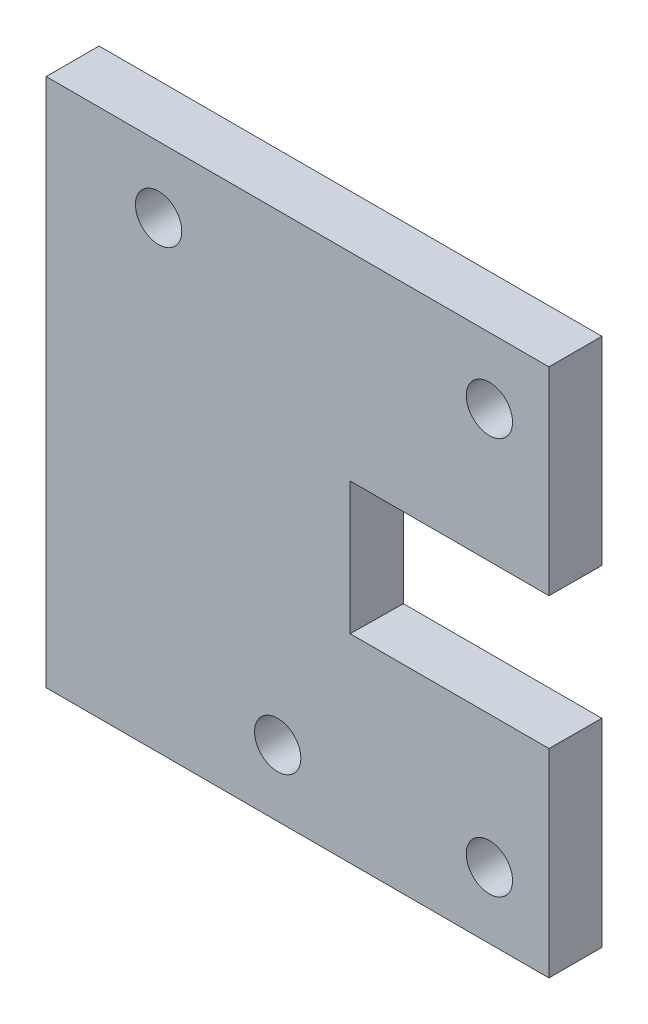
ISO-10303-21;
HEADER;
FILE_DESCRIPTION(('STEP AP214'),'2;1');
FILE_NAME('part.step','',(''),(''),'','','');
FILE_SCHEMA(('AUTOMOTIVE_DESIGN { 1 0 10303 214 1 1 1 1 }'));
ENDSEC;
DATA;
#1=APPLICATION_CONTEXT('core data for automotive mechanical design processes');
#2=APPLICATION_PROTOCOL_DEFINITION('international standard','automotive_design',2000,#1);
#3=PRODUCT_CONTEXT('',#1,'mechanical');
#4=PRODUCT('Part','Part','',(#3));
#5=PRODUCT_RELATED_PRODUCT_CATEGORY('part','',(#4));
#6=PRODUCT_DEFINITION_FORMATION('','',#4);
#7=PRODUCT_DEFINITION_CONTEXT('part definition',#1,'design');
#8=PRODUCT_DEFINITION('design','',#6,#7);
#9=PRODUCT_DEFINITION_SHAPE('','',#8);
#10=(LENGTH_UNIT() NAMED_UNIT(*) SI_UNIT(.MILLI.,.METRE.));
#11=(NAMED_UNIT(*) PLANE_ANGLE_UNIT() SI_UNIT($,.RADIAN.));
#12=(NAMED_UNIT(*) SI_UNIT($,.STERADIAN.) SOLID_ANGLE_UNIT());
#13=UNCERTAINTY_MEASURE_WITH_UNIT(LENGTH_MEASURE(1.E-05),#10,'distance_accuracy_value','');
#14=(GEOMETRIC_REPRESENTATION_CONTEXT(3) GLOBAL_UNCERTAINTY_ASSIGNED_CONTEXT((#13)) GLOBAL_UNIT_ASSIGNED_CONTEXT((#10,
#11,#12)) REPRESENTATION_CONTEXT('',''));
#15=CARTESIAN_POINT('',(0.,0.,0.));
#16=DIRECTION('',(0.,0.,1.));
#17=DIRECTION('',(1.,0.,0.));
#18=AXIS2_PLACEMENT_3D('',#15,#16,#17);
#19=CARTESIAN_POINT('',(0.,0.,4.));
#20=DIRECTION('',(0.,0.,1.));
#21=DIRECTION('',(1.,0.,0.));
#22=AXIS2_PLACEMENT_3D('',#19,#20,#21);
#23=PLANE('',#22);
#24=CARTESIAN_POINT('',(-4.50000000000001,15.,4.));
#25=DIRECTION('',(0.,0.,1.));
#26=DIRECTION('',(1.,0.,0.));
#27=AXIS2_PLACEMENT_3D('',#24,#25,#26);
#28=CIRCLE('',#27,1.75);
#29=CARTESIAN_POINT('',(-2.75000000000001,15.,4.));
#30=VERTEX_POINT('',#29);
#31=EDGE_CURVE('E161',#30,#30,#28,.T.);
#32=ORIENTED_EDGE('',*,*,#31,.F.);
#33=EDGE_LOOP('',(#32));
#34=FACE_BOUND('',#33,.T.);
#35=CARTESIAN_POINT('',(20.5,15.,4.));
#36=DIRECTION('',(0.,0.,1.));
#37=DIRECTION('',(1.,0.,0.));
#38=AXIS2_PLACEMENT_3D('',#35,#36,#37);
#39=CIRCLE('',#38,1.75);
#40=CARTESIAN_POINT('',(22.25,15.,4.));
#41=VERTEX_POINT('',#40);
#42=EDGE_CURVE('E168',#41,#41,#39,.T.);
#43=ORIENTED_EDGE('',*,*,#42,.F.);
#44=EDGE_LOOP('',(#43));
#45=FACE_BOUND('',#44,.T.);
#46=CARTESIAN_POINT('',(20.5,-15.,4.));
#47=DIRECTION('',(0.,0.,1.));
#48=DIRECTION('',(1.,0.,0.));
#49=AXIS2_PLACEMENT_3D('',#46,#47,#48);
#50=CIRCLE('',#49,1.75);
#51=CARTESIAN_POINT('',(22.25,-15.,4.));
#52=VERTEX_POINT('',#51);
#53=EDGE_CURVE('E174',#52,#52,#50,.T.);
#54=ORIENTED_EDGE('',*,*,#53,.F.);
#55=EDGE_LOOP('',(#54));
#56=FACE_BOUND('',#55,.T.);
#57=CARTESIAN_POINT('',(4.5,-15.,4.));
#58=DIRECTION('',(0.,0.,1.));
#59=DIRECTION('',(1.,0.,0.));
#60=AXIS2_PLACEMENT_3D('',#57,#58,#59);
#61=CIRCLE('',#60,1.75);
#62=CARTESIAN_POINT('',(6.25,-15.,4.));
#63=VERTEX_POINT('',#62);
#64=EDGE_CURVE('E180',#63,#63,#61,.T.);
#65=ORIENTED_EDGE('',*,*,#64,.F.);
#66=EDGE_LOOP('',(#65));
#67=FACE_BOUND('',#66,.T.);
#68=DIRECTION('',(0.,-1.,0.));
#69=VECTOR('',#68,1.);
#70=CARTESIAN_POINT('',(9.9725607254456,5.02042421616366,4.));
#71=LINE('',#70,#69);
#72=CARTESIAN_POINT('',(9.9725607254456,5.02042421616366,4.));
#73=VERTEX_POINT('',#72);
#74=CARTESIAN_POINT('',(9.9725607254456,-4.97957578383634,4.));
#75=VERTEX_POINT('',#74);
#76=EDGE_CURVE('E144',#73,#75,#71,.T.);
#77=ORIENTED_EDGE('',*,*,#76,.F.);
#78=DIRECTION('',(-1.,0.,0.));
#79=VECTOR('',#78,1.);
#80=CARTESIAN_POINT('',(9.9725607254456,5.02042421616366,4.));
#81=LINE('',#80,#79);
#82=CARTESIAN_POINT('',(25.,5.02042421616366,4.));
#83=VERTEX_POINT('',#82);
#84=EDGE_CURVE('E119',#83,#73,#81,.T.);
#85=ORIENTED_EDGE('',*,*,#84,.F.);
#86=DIRECTION('',(0.,1.,0.));
#87=VECTOR('',#86,1.);
#88=CARTESIAN_POINT('',(25.,-20.,4.));
#89=LINE('',#88,#87);
#90=CARTESIAN_POINT('',(25.,20.,4.));
#91=VERTEX_POINT('',#90);
#92=EDGE_CURVE('E187',#83,#91,#89,.T.);
#93=ORIENTED_EDGE('',*,*,#92,.T.);
#94=DIRECTION('',(-1.,0.,0.));
#95=VECTOR('',#94,1.);
#96=CARTESIAN_POINT('',(25.,20.,4.));
#97=LINE('',#96,#95);
#98=CARTESIAN_POINT('',(-13.,20.,4.));
#99=VERTEX_POINT('',#98);
#100=EDGE_CURVE('E191',#91,#99,#97,.T.);
#101=ORIENTED_EDGE('',*,*,#100,.T.);
#102=DIRECTION('',(0.,1.,0.));
#103=VECTOR('',#102,1.);
#104=CARTESIAN_POINT('',(-13.,-20.,4.));
#105=LINE('',#104,#103);
#106=CARTESIAN_POINT('',(-13.,-20.,4.));
#107=VERTEX_POINT('',#106);
#108=EDGE_CURVE('E158',#107,#99,#105,.T.);
#109=ORIENTED_EDGE('',*,*,#108,.F.);
#110=DIRECTION('',(1.,0.,0.));
#111=VECTOR('',#110,1.);
#112=CARTESIAN_POINT('',(25.,-20.,4.));
#113=LINE('',#112,#111);
#114=CARTESIAN_POINT('',(25.,-20.,4.));
#115=VERTEX_POINT('',#114);
#116=EDGE_CURVE('E185',#107,#115,#113,.T.);
#117=ORIENTED_EDGE('',*,*,#116,.T.);
#118=CARTESIAN_POINT('',(25.,-4.97957578383634,4.));
#119=VERTEX_POINT('',#118);
#120=EDGE_CURVE('E197',#115,#119,#89,.T.);
#121=ORIENTED_EDGE('',*,*,#120,.T.);
#122=DIRECTION('',(1.,0.,0.));
#123=VECTOR('',#122,1.);
#124=CARTESIAN_POINT('',(9.9725607254456,-4.97957578383634,4.));
#125=LINE('',#124,#123);
#126=EDGE_CURVE('E64',#75,#119,#125,.T.);
#127=ORIENTED_EDGE('',*,*,#126,.F.);
#128=EDGE_LOOP('',(#77,#85,#93,#101,#109,#117,#121,#127));
#129=FACE_BOUND('',#128,.T.);
#130=ADVANCED_FACE('F47',(#34,#45,#56,#67,#129),#23,.T.);
#131=CARTESIAN_POINT('',(0.,0.,0.));
#132=DIRECTION('',(0.,0.,1.));
#133=DIRECTION('',(1.,0.,0.));
#134=AXIS2_PLACEMENT_3D('',#131,#132,#133);
#135=PLANE('',#134);
#136=CARTESIAN_POINT('',(4.5,-15.,0.));
#137=DIRECTION('',(0.,0.,1.));
#138=DIRECTION('',(1.,0.,0.));
#139=AXIS2_PLACEMENT_3D('',#136,#137,#138);
#140=CIRCLE('',#139,1.75);
#141=CARTESIAN_POINT('',(6.25,-15.,0.));
#142=VERTEX_POINT('',#141);
#143=EDGE_CURVE('E160',#142,#142,#140,.T.);
#144=ORIENTED_EDGE('',*,*,#143,.T.);
#145=EDGE_LOOP('',(#144));
#146=FACE_BOUND('',#145,.T.);
#147=CARTESIAN_POINT('',(20.5,-15.,0.));
#148=DIRECTION('',(0.,0.,1.));
#149=DIRECTION('',(1.,0.,0.));
#150=AXIS2_PLACEMENT_3D('',#147,#148,#149);
#151=CIRCLE('',#150,1.75);
#152=CARTESIAN_POINT('',(22.25,-15.,0.));
#153=VERTEX_POINT('',#152);
#154=EDGE_CURVE('E177',#153,#153,#151,.T.);
#155=ORIENTED_EDGE('',*,*,#154,.T.);
#156=EDGE_LOOP('',(#155));
#157=FACE_BOUND('',#156,.T.);
#158=CARTESIAN_POINT('',(20.5,15.,0.));
#159=DIRECTION('',(0.,0.,1.));
#160=DIRECTION('',(1.,0.,0.));
#161=AXIS2_PLACEMENT_3D('',#158,#159,#160);
#162=CIRCLE('',#161,1.75);
#163=CARTESIAN_POINT('',(22.25,15.,0.));
#164=VERTEX_POINT('',#163);
#165=EDGE_CURVE('E171',#164,#164,#162,.T.);
#166=ORIENTED_EDGE('',*,*,#165,.T.);
#167=EDGE_LOOP('',(#166));
#168=FACE_BOUND('',#167,.T.);
#169=CARTESIAN_POINT('',(-4.50000000000001,15.,0.));
#170=DIRECTION('',(0.,0.,1.));
#171=DIRECTION('',(1.,0.,0.));
#172=AXIS2_PLACEMENT_3D('',#169,#170,#171);
#173=CIRCLE('',#172,1.75);
#174=CARTESIAN_POINT('',(-2.75000000000001,15.,0.));
#175=VERTEX_POINT('',#174);
#176=EDGE_CURVE('E165',#175,#175,#173,.T.);
#177=ORIENTED_EDGE('',*,*,#176,.T.);
#178=EDGE_LOOP('',(#177));
#179=FACE_BOUND('',#178,.T.);
#180=DIRECTION('',(-1.,0.,0.));
#181=VECTOR('',#180,1.);
#182=CARTESIAN_POINT('',(26.,5.,0.));
#183=LINE('',#182,#181);
#184=CARTESIAN_POINT('',(25.,5.,0.));
#185=VERTEX_POINT('',#184);
#186=CARTESIAN_POINT('',(9.99999999999999,5.,0.));
#187=VERTEX_POINT('',#186);
#188=EDGE_CURVE('E116',#185,#187,#183,.T.);
#189=ORIENTED_EDGE('',*,*,#188,.T.);
#190=DIRECTION('',(0.,-1.,0.));
#191=VECTOR('',#190,1.);
#192=CARTESIAN_POINT('',(9.99999999999999,5.,0.));
#193=LINE('',#192,#191);
#194=CARTESIAN_POINT('',(9.99999999999999,-5.,0.));
#195=VERTEX_POINT('',#194);
#196=EDGE_CURVE('E126',#187,#195,#193,.T.);
#197=ORIENTED_EDGE('',*,*,#196,.T.);
#198=DIRECTION('',(1.,0.,0.));
#199=VECTOR('',#198,1.);
#200=CARTESIAN_POINT('',(26.,-5.,0.));
#201=LINE('',#200,#199);
#202=CARTESIAN_POINT('',(25.,-5.,0.));
#203=VERTEX_POINT('',#202);
#204=EDGE_CURVE('E131',#195,#203,#201,.T.);
#205=ORIENTED_EDGE('',*,*,#204,.T.);
#206=DIRECTION('',(0.,1.,0.));
#207=VECTOR('',#206,1.);
#208=CARTESIAN_POINT('',(25.,-20.,0.));
#209=LINE('',#208,#207);
#210=CARTESIAN_POINT('',(25.,-20.,0.));
#211=VERTEX_POINT('',#210);
#212=EDGE_CURVE('E202',#211,#203,#209,.T.);
#213=ORIENTED_EDGE('',*,*,#212,.F.);
#214=DIRECTION('',(1.,0.,0.));
#215=VECTOR('',#214,1.);
#216=CARTESIAN_POINT('',(25.,-20.,0.));
#217=LINE('',#216,#215);
#218=CARTESIAN_POINT('',(-13.,-20.,0.));
#219=VERTEX_POINT('',#218);
#220=EDGE_CURVE('E164',#219,#211,#217,.T.);
#221=ORIENTED_EDGE('',*,*,#220,.F.);
#222=DIRECTION('',(0.,-1.,0.));
#223=VECTOR('',#222,1.);
#224=CARTESIAN_POINT('',(-13.,20.,0.));
#225=LINE('',#224,#223);
#226=CARTESIAN_POINT('',(-13.,20.,0.));
#227=VERTEX_POINT('',#226);
#228=EDGE_CURVE('E149',#227,#219,#225,.T.);
#229=ORIENTED_EDGE('',*,*,#228,.F.);
#230=DIRECTION('',(-1.,0.,0.));
#231=VECTOR('',#230,1.);
#232=CARTESIAN_POINT('',(25.,20.,0.));
#233=LINE('',#232,#231);
#234=CARTESIAN_POINT('',(25.,20.,0.));
#235=VERTEX_POINT('',#234);
#236=EDGE_CURVE('E188',#235,#227,#233,.T.);
#237=ORIENTED_EDGE('',*,*,#236,.F.);
#238=EDGE_CURVE('E136',#185,#235,#209,.T.);
#239=ORIENTED_EDGE('',*,*,#238,.F.);
#240=EDGE_LOOP('',(#189,#197,#205,#213,#221,#229,#237,#239));
#241=FACE_BOUND('',#240,.T.);
#242=ADVANCED_FACE('F134',(#146,#157,#168,#179,#241),#135,.F.);
#243=CARTESIAN_POINT('',(25.,-20.,4.));
#244=DIRECTION('',(-1.,0.,0.));
#245=DIRECTION('',(0.,0.,1.));
#246=AXIS2_PLACEMENT_3D('',#243,#244,#245);
#247=PLANE('',#246);
#248=DIRECTION('',(0.,0.0051059874802384,0.999986964360962));
#249=VECTOR('',#248,1.);
#250=CARTESIAN_POINT('',(25.,5.019771905978,3.87224769255669));
#251=LINE('',#250,#249);
#252=EDGE_CURVE('E12',#185,#83,#251,.T.);
#253=ORIENTED_EDGE('',*,*,#252,.F.);
#254=ORIENTED_EDGE('',*,*,#238,.T.);
#255=DIRECTION('',(0.,0.,-1.));
#256=VECTOR('',#255,1.);
#257=CARTESIAN_POINT('',(25.,20.,4.));
#258=LINE('',#257,#256);
#259=EDGE_CURVE('E209',#91,#235,#258,.T.);
#260=ORIENTED_EDGE('',*,*,#259,.F.);
#261=ORIENTED_EDGE('',*,*,#92,.F.);
#262=EDGE_LOOP('',(#253,#254,#260,#261));
#263=FACE_BOUND('',#262,.T.);
#264=ADVANCED_FACE('F239',(#263),#247,.F.);
#265=DIRECTION('',(0.,-0.00510598748023732,-0.999986964360962));
#266=VECTOR('',#265,1.);
#267=CARTESIAN_POINT('',(25.,-4.97996738294051,3.92330690176099));
#268=LINE('',#267,#266);
#269=EDGE_CURVE('E56',#119,#203,#268,.T.);
#270=ORIENTED_EDGE('',*,*,#269,.F.);
#271=ORIENTED_EDGE('',*,*,#120,.F.);
#272=DIRECTION('',(0.,0.,-1.));
#273=VECTOR('',#272,1.);
#274=CARTESIAN_POINT('',(25.,-20.,4.));
#275=LINE('',#274,#273);
#276=EDGE_CURVE('E211',#115,#211,#275,.T.);
#277=ORIENTED_EDGE('',*,*,#276,.T.);
#278=ORIENTED_EDGE('',*,*,#212,.T.);
#279=EDGE_LOOP('',(#270,#271,#277,#278));
#280=FACE_BOUND('',#279,.T.);
#281=ADVANCED_FACE('F226',(#280),#247,.F.);
#282=CARTESIAN_POINT('',(25.,-20.,4.));
#283=DIRECTION('',(0.,1.,0.));
#284=DIRECTION('',(-1.,0.,0.));
#285=AXIS2_PLACEMENT_3D('',#282,#283,#284);
#286=PLANE('',#285);
#287=DIRECTION('',(0.,0.,1.));
#288=VECTOR('',#287,1.);
#289=CARTESIAN_POINT('',(-13.,-20.,0.));
#290=LINE('',#289,#288);
#291=EDGE_CURVE('E151',#219,#107,#290,.T.);
#292=ORIENTED_EDGE('',*,*,#291,.F.);
#293=ORIENTED_EDGE('',*,*,#220,.T.);
#294=ORIENTED_EDGE('',*,*,#276,.F.);
#295=ORIENTED_EDGE('',*,*,#116,.F.);
#296=EDGE_LOOP('',(#292,#293,#294,#295));
#297=FACE_BOUND('',#296,.T.);
#298=ADVANCED_FACE('F49',(#297),#286,.F.);
#299=CARTESIAN_POINT('',(25.,20.,4.));
#300=DIRECTION('',(0.,-1.,0.));
#301=DIRECTION('',(1.,0.,0.));
#302=AXIS2_PLACEMENT_3D('',#299,#300,#301);
#303=PLANE('',#302);
#304=DIRECTION('',(0.,0.,-1.));
#305=VECTOR('',#304,1.);
#306=CARTESIAN_POINT('',(-13.,20.,4.));
#307=LINE('',#306,#305);
#308=EDGE_CURVE('E72',#99,#227,#307,.T.);
#309=ORIENTED_EDGE('',*,*,#308,.F.);
#310=ORIENTED_EDGE('',*,*,#100,.F.);
#311=ORIENTED_EDGE('',*,*,#259,.T.);
#312=ORIENTED_EDGE('',*,*,#236,.T.);
#313=EDGE_LOOP('',(#309,#310,#311,#312));
#314=FACE_BOUND('',#313,.T.);
#315=ADVANCED_FACE('F234',(#314),#303,.F.);
#316=CARTESIAN_POINT('',(-4.50000000000001,15.,0.));
#317=DIRECTION('',(0.,0.,1.));
#318=DIRECTION('',(1.,0.,0.));
#319=AXIS2_PLACEMENT_3D('',#316,#317,#318);
#320=CYLINDRICAL_SURFACE('',#319,1.75);
#321=ORIENTED_EDGE('',*,*,#176,.F.);
#322=EDGE_LOOP('',(#321));
#323=FACE_BOUND('',#322,.T.);
#324=ORIENTED_EDGE('',*,*,#31,.T.);
#325=EDGE_LOOP('',(#324));
#326=FACE_BOUND('',#325,.T.);
#327=ADVANCED_FACE('F259',(#323,#326),#320,.F.);
#328=CARTESIAN_POINT('',(20.5,15.,0.));
#329=DIRECTION('',(0.,0.,1.));
#330=DIRECTION('',(1.,0.,0.));
#331=AXIS2_PLACEMENT_3D('',#328,#329,#330);
#332=CYLINDRICAL_SURFACE('',#331,1.75);
#333=ORIENTED_EDGE('',*,*,#165,.F.);
#334=EDGE_LOOP('',(#333));
#335=FACE_BOUND('',#334,.T.);
#336=ORIENTED_EDGE('',*,*,#42,.T.);
#337=EDGE_LOOP('',(#336));
#338=FACE_BOUND('',#337,.T.);
#339=ADVANCED_FACE('F264',(#335,#338),#332,.F.);
#340=CARTESIAN_POINT('',(20.5,-15.,0.));
#341=DIRECTION('',(0.,0.,1.));
#342=DIRECTION('',(1.,0.,0.));
#343=AXIS2_PLACEMENT_3D('',#340,#341,#342);
#344=CYLINDRICAL_SURFACE('',#343,1.75);
#345=ORIENTED_EDGE('',*,*,#154,.F.);
#346=EDGE_LOOP('',(#345));
#347=FACE_BOUND('',#346,.T.);
#348=ORIENTED_EDGE('',*,*,#53,.T.);
#349=EDGE_LOOP('',(#348));
#350=FACE_BOUND('',#349,.T.);
#351=ADVANCED_FACE('F353',(#347,#350),#344,.F.);
#352=CARTESIAN_POINT('',(4.5,-15.,0.));
#353=DIRECTION('',(0.,0.,1.));
#354=DIRECTION('',(1.,0.,0.));
#355=AXIS2_PLACEMENT_3D('',#352,#353,#354);
#356=CYLINDRICAL_SURFACE('',#355,1.75);
#357=ORIENTED_EDGE('',*,*,#143,.F.);
#358=EDGE_LOOP('',(#357));
#359=FACE_BOUND('',#358,.T.);
#360=ORIENTED_EDGE('',*,*,#64,.T.);
#361=EDGE_LOOP('',(#360));
#362=FACE_BOUND('',#361,.T.);
#363=ADVANCED_FACE('F256',(#359,#362),#356,.F.);
#364=CARTESIAN_POINT('',(-13.,0.,0.));
#365=DIRECTION('',(-1.,0.,0.));
#366=DIRECTION('',(0.,0.,1.));
#367=AXIS2_PLACEMENT_3D('',#364,#365,#366);
#368=PLANE('',#367);
#369=ORIENTED_EDGE('',*,*,#308,.T.);
#370=ORIENTED_EDGE('',*,*,#228,.T.);
#371=ORIENTED_EDGE('',*,*,#291,.T.);
#372=ORIENTED_EDGE('',*,*,#108,.T.);
#373=EDGE_LOOP('',(#369,#370,#371,#372));
#374=FACE_BOUND('',#373,.T.);
#375=ADVANCED_FACE('F288',(#374),#368,.T.);
#376=CARTESIAN_POINT('',(0.,4.99986964445926,-0.0255296046021434));
#377=DIRECTION('',(0.,-0.999986964360962,0.0051059874802384));
#378=DIRECTION('',(0.,-0.0051059874802384,-0.999986964360962));
#379=AXIS2_PLACEMENT_3D('',#376,#377,#378);
#380=PLANE('',#379);
#381=ORIENTED_EDGE('',*,*,#252,.T.);
#382=ORIENTED_EDGE('',*,*,#84,.T.);
#383=DIRECTION('',(-0.00685956782686151,0.00510586735109832,0.999963437555505));
#384=VECTOR('',#383,1.);
#385=CARTESIAN_POINT('',(9.99999999999999,5.,0.));
#386=LINE('',#385,#384);
#387=EDGE_CURVE('E112',#187,#73,#386,.T.);
#388=ORIENTED_EDGE('',*,*,#387,.F.);
#389=ORIENTED_EDGE('',*,*,#188,.F.);
#390=EDGE_LOOP('',(#381,#382,#388,#389));
#391=FACE_BOUND('',#390,.T.);
#392=ADVANCED_FACE('F114',(#391),#380,.T.);
#393=CARTESIAN_POINT('',(0.,-4.99986964445926,0.0255296046021379));
#394=DIRECTION('',(0.,0.999986964360962,-0.00510598748023732));
#395=DIRECTION('',(0.,0.00510598748023732,0.999986964360962));
#396=AXIS2_PLACEMENT_3D('',#393,#394,#395);
#397=PLANE('',#396);
#398=ORIENTED_EDGE('',*,*,#269,.T.);
#399=ORIENTED_EDGE('',*,*,#204,.F.);
#400=DIRECTION('',(-0.00685956782686151,0.00510586735109789,0.999963437555505));
#401=VECTOR('',#400,1.);
#402=CARTESIAN_POINT('',(9.99999999999999,-5.,0.));
#403=LINE('',#402,#401);
#404=EDGE_CURVE('E123',#195,#75,#403,.T.);
#405=ORIENTED_EDGE('',*,*,#404,.T.);
#406=ORIENTED_EDGE('',*,*,#126,.T.);
#407=EDGE_LOOP('',(#398,#399,#405,#406));
#408=FACE_BOUND('',#407,.T.);
#409=ADVANCED_FACE('F287',(#408),#397,.T.);
#410=CARTESIAN_POINT('',(9.99952945102513,0.,0.0685949585053691));
#411=DIRECTION('',(0.99997647227448,0.,0.00685965724266969));
#412=DIRECTION('',(0.00685965724266969,0.,-0.99997647227448));
#413=AXIS2_PLACEMENT_3D('',#410,#411,#412);
#414=PLANE('',#413);
#415=ORIENTED_EDGE('',*,*,#404,.F.);
#416=ORIENTED_EDGE('',*,*,#196,.F.);
#417=ORIENTED_EDGE('',*,*,#387,.T.);
#418=ORIENTED_EDGE('',*,*,#76,.T.);
#419=EDGE_LOOP('',(#415,#416,#417,#418));
#420=FACE_BOUND('',#419,.T.);
#421=ADVANCED_FACE('F127',(#420),#414,.T.);
#422=CLOSED_SHELL('',(#130,#242,#264,#281,#298,#315,#327,#339,#351,#363,#375,#392,#409,#421));
#423=MANIFOLD_SOLID_BREP('B2',#422);
#424=ADVANCED_BREP_SHAPE_REPRESENTATION('',(#18,#423),#14);
#425=SHAPE_DEFINITION_REPRESENTATION(#9,#424);
ENDSEC;
END-ISO-10303-21;
